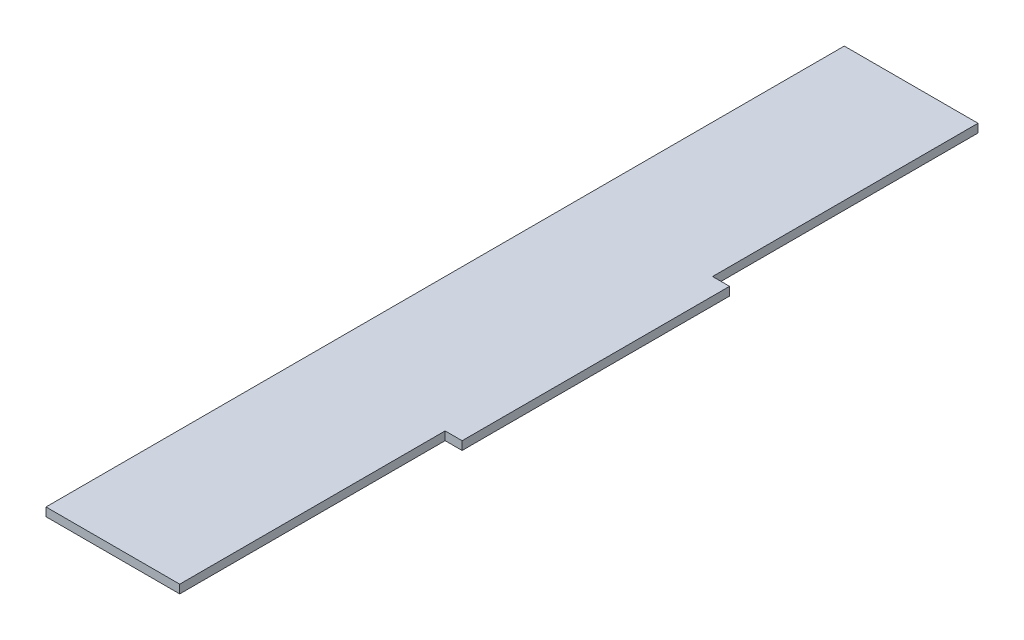
ISO-10303-21;
HEADER;
FILE_DESCRIPTION(('STEP AP214'),'2;1');
FILE_NAME('part.step','',(''),(''),'','','');
FILE_SCHEMA(('AUTOMOTIVE_DESIGN { 1 0 10303 214 1 1 1 1 }'));
ENDSEC;
DATA;
#1=APPLICATION_CONTEXT('core data for automotive mechanical design processes');
#2=APPLICATION_PROTOCOL_DEFINITION('international standard','automotive_design',2000,#1);
#3=PRODUCT_CONTEXT('',#1,'mechanical');
#4=PRODUCT('Part','Part','',(#3));
#5=PRODUCT_RELATED_PRODUCT_CATEGORY('part','',(#4));
#6=PRODUCT_DEFINITION_FORMATION('','',#4);
#7=PRODUCT_DEFINITION_CONTEXT('part definition',#1,'design');
#8=PRODUCT_DEFINITION('design','',#6,#7);
#9=PRODUCT_DEFINITION_SHAPE('','',#8);
#10=(LENGTH_UNIT() NAMED_UNIT(*) SI_UNIT(.MILLI.,.METRE.));
#11=(NAMED_UNIT(*) PLANE_ANGLE_UNIT() SI_UNIT($,.RADIAN.));
#12=(NAMED_UNIT(*) SI_UNIT($,.STERADIAN.) SOLID_ANGLE_UNIT());
#13=UNCERTAINTY_MEASURE_WITH_UNIT(LENGTH_MEASURE(1.E-05),#10,'distance_accuracy_value','');
#14=(GEOMETRIC_REPRESENTATION_CONTEXT(3) GLOBAL_UNCERTAINTY_ASSIGNED_CONTEXT((#13)) GLOBAL_UNIT_ASSIGNED_CONTEXT((#10,
#11,#12)) REPRESENTATION_CONTEXT('',''));
#15=CARTESIAN_POINT('',(0.,0.,0.));
#16=DIRECTION('',(0.,0.,1.));
#17=DIRECTION('',(1.,0.,0.));
#18=AXIS2_PLACEMENT_3D('',#15,#16,#17);
#19=CARTESIAN_POINT('',(-25.,3.175,0.));
#20=DIRECTION('',(-1.,0.,0.));
#21=DIRECTION('',(0.,0.,1.));
#22=AXIS2_PLACEMENT_3D('',#19,#20,#21);
#23=PLANE('',#22);
#24=DIRECTION('',(0.,0.,-1.));
#25=VECTOR('',#24,1.);
#26=CARTESIAN_POINT('',(-25.,0.,0.));
#27=LINE('',#26,#25);
#28=CARTESIAN_POINT('',(-25.,0.,199.25));
#29=VERTEX_POINT('',#28);
#30=CARTESIAN_POINT('',(-25.,0.,-99.25));
#31=VERTEX_POINT('',#30);
#32=EDGE_CURVE('E127',#29,#31,#27,.T.);
#33=ORIENTED_EDGE('',*,*,#32,.F.);
#34=DIRECTION('',(0.,-1.,0.));
#35=VECTOR('',#34,1.);
#36=CARTESIAN_POINT('',(-25.,3.175,199.25));
#37=LINE('',#36,#35);
#38=CARTESIAN_POINT('',(-25.,3.175,199.25));
#39=VERTEX_POINT('',#38);
#40=EDGE_CURVE('E11',#39,#29,#37,.T.);
#41=ORIENTED_EDGE('',*,*,#40,.F.);
#42=DIRECTION('',(0.,0.,-1.));
#43=VECTOR('',#42,1.);
#44=CARTESIAN_POINT('',(-25.,3.175,0.));
#45=LINE('',#44,#43);
#46=CARTESIAN_POINT('',(-25.,3.175,-99.25));
#47=VERTEX_POINT('',#46);
#48=EDGE_CURVE('E147',#39,#47,#45,.T.);
#49=ORIENTED_EDGE('',*,*,#48,.T.);
#50=DIRECTION('',(0.,-1.,0.));
#51=VECTOR('',#50,1.);
#52=CARTESIAN_POINT('',(-25.,3.175,-99.25));
#53=LINE('',#52,#51);
#54=EDGE_CURVE('E50',#47,#31,#53,.T.);
#55=ORIENTED_EDGE('',*,*,#54,.T.);
#56=EDGE_LOOP('',(#33,#41,#49,#55));
#57=FACE_BOUND('',#56,.T.);
#58=ADVANCED_FACE('F34',(#57),#23,.T.);
#59=CARTESIAN_POINT('',(0.,3.175,199.25));
#60=DIRECTION('',(0.,0.,1.));
#61=DIRECTION('',(1.,0.,0.));
#62=AXIS2_PLACEMENT_3D('',#59,#60,#61);
#63=PLANE('',#62);
#64=DIRECTION('',(-1.,0.,0.));
#65=VECTOR('',#64,1.);
#66=CARTESIAN_POINT('',(0.,0.,199.25));
#67=LINE('',#66,#65);
#68=CARTESIAN_POINT('',(25.,0.,199.25));
#69=VERTEX_POINT('',#68);
#70=EDGE_CURVE('E129',#69,#29,#67,.T.);
#71=ORIENTED_EDGE('',*,*,#70,.F.);
#72=DIRECTION('',(0.,-1.,0.));
#73=VECTOR('',#72,1.);
#74=CARTESIAN_POINT('',(25.,3.175,199.25));
#75=LINE('',#74,#73);
#76=CARTESIAN_POINT('',(25.,3.175,199.25));
#77=VERTEX_POINT('',#76);
#78=EDGE_CURVE('E42',#77,#69,#75,.T.);
#79=ORIENTED_EDGE('',*,*,#78,.F.);
#80=DIRECTION('',(-1.,0.,0.));
#81=VECTOR('',#80,1.);
#82=CARTESIAN_POINT('',(0.,3.175,199.25));
#83=LINE('',#82,#81);
#84=EDGE_CURVE('E173',#77,#39,#83,.T.);
#85=ORIENTED_EDGE('',*,*,#84,.T.);
#86=ORIENTED_EDGE('',*,*,#40,.T.);
#87=EDGE_LOOP('',(#71,#79,#85,#86));
#88=FACE_BOUND('',#87,.T.);
#89=ADVANCED_FACE('F164',(#88),#63,.T.);
#90=CARTESIAN_POINT('',(25.,3.175,0.));
#91=DIRECTION('',(1.,0.,0.));
#92=DIRECTION('',(0.,0.,-1.));
#93=AXIS2_PLACEMENT_3D('',#90,#91,#92);
#94=PLANE('',#93);
#95=DIRECTION('',(0.,0.,1.));
#96=VECTOR('',#95,1.);
#97=CARTESIAN_POINT('',(25.,0.,0.));
#98=LINE('',#97,#96);
#99=CARTESIAN_POINT('',(25.,0.,100.));
#100=VERTEX_POINT('',#99);
#101=EDGE_CURVE('E132',#100,#69,#98,.T.);
#102=ORIENTED_EDGE('',*,*,#101,.F.);
#103=DIRECTION('',(0.,-1.,0.));
#104=VECTOR('',#103,1.);
#105=CARTESIAN_POINT('',(25.,3.175,100.));
#106=LINE('',#105,#104);
#107=CARTESIAN_POINT('',(25.,3.175,100.));
#108=VERTEX_POINT('',#107);
#109=EDGE_CURVE('E153',#108,#100,#106,.T.);
#110=ORIENTED_EDGE('',*,*,#109,.F.);
#111=DIRECTION('',(0.,0.,1.));
#112=VECTOR('',#111,1.);
#113=CARTESIAN_POINT('',(25.,3.175,0.));
#114=LINE('',#113,#112);
#115=EDGE_CURVE('E160',#108,#77,#114,.T.);
#116=ORIENTED_EDGE('',*,*,#115,.T.);
#117=ORIENTED_EDGE('',*,*,#78,.T.);
#118=EDGE_LOOP('',(#102,#110,#116,#117));
#119=FACE_BOUND('',#118,.T.);
#120=ADVANCED_FACE('F158',(#119),#94,.T.);
#121=CARTESIAN_POINT('',(0.,3.175,100.));
#122=DIRECTION('',(0.,0.,1.));
#123=DIRECTION('',(1.,0.,0.));
#124=AXIS2_PLACEMENT_3D('',#121,#122,#123);
#125=PLANE('',#124);
#126=DIRECTION('',(-1.,0.,0.));
#127=VECTOR('',#126,1.);
#128=CARTESIAN_POINT('',(0.,0.,100.));
#129=LINE('',#128,#127);
#130=CARTESIAN_POINT('',(31.35,0.,100.));
#131=VERTEX_POINT('',#130);
#132=EDGE_CURVE('E135',#131,#100,#129,.T.);
#133=ORIENTED_EDGE('',*,*,#132,.F.);
#134=DIRECTION('',(0.,-1.,0.));
#135=VECTOR('',#134,1.);
#136=CARTESIAN_POINT('',(31.35,3.175,100.));
#137=LINE('',#136,#135);
#138=CARTESIAN_POINT('',(31.35,3.175,100.));
#139=VERTEX_POINT('',#138);
#140=EDGE_CURVE('E151',#139,#131,#137,.T.);
#141=ORIENTED_EDGE('',*,*,#140,.F.);
#142=DIRECTION('',(-1.,0.,0.));
#143=VECTOR('',#142,1.);
#144=CARTESIAN_POINT('',(0.,3.175,100.));
#145=LINE('',#144,#143);
#146=EDGE_CURVE('E172',#139,#108,#145,.T.);
#147=ORIENTED_EDGE('',*,*,#146,.T.);
#148=ORIENTED_EDGE('',*,*,#109,.T.);
#149=EDGE_LOOP('',(#133,#141,#147,#148));
#150=FACE_BOUND('',#149,.T.);
#151=ADVANCED_FACE('F170',(#150),#125,.T.);
#152=CARTESIAN_POINT('',(31.35,3.175,0.));
#153=DIRECTION('',(1.,0.,0.));
#154=DIRECTION('',(0.,0.,-1.));
#155=AXIS2_PLACEMENT_3D('',#152,#153,#154);
#156=PLANE('',#155);
#157=DIRECTION('',(0.,0.,1.));
#158=VECTOR('',#157,1.);
#159=CARTESIAN_POINT('',(31.35,0.,0.));
#160=LINE('',#159,#158);
#161=CARTESIAN_POINT('',(31.35,0.,0.));
#162=VERTEX_POINT('',#161);
#163=EDGE_CURVE('E138',#162,#131,#160,.T.);
#164=ORIENTED_EDGE('',*,*,#163,.F.);
#165=DIRECTION('',(0.,-1.,0.));
#166=VECTOR('',#165,1.);
#167=CARTESIAN_POINT('',(31.35,3.175,0.));
#168=LINE('',#167,#166);
#169=CARTESIAN_POINT('',(31.35,3.175,0.));
#170=VERTEX_POINT('',#169);
#171=EDGE_CURVE('E109',#170,#162,#168,.T.);
#172=ORIENTED_EDGE('',*,*,#171,.F.);
#173=DIRECTION('',(0.,0.,1.));
#174=VECTOR('',#173,1.);
#175=CARTESIAN_POINT('',(31.35,3.175,0.));
#176=LINE('',#175,#174);
#177=EDGE_CURVE('E119',#170,#139,#176,.T.);
#178=ORIENTED_EDGE('',*,*,#177,.T.);
#179=ORIENTED_EDGE('',*,*,#140,.T.);
#180=EDGE_LOOP('',(#164,#172,#178,#179));
#181=FACE_BOUND('',#180,.T.);
#182=ADVANCED_FACE('F179',(#181),#156,.T.);
#183=CARTESIAN_POINT('',(0.,3.175,0.));
#184=DIRECTION('',(0.,0.,-1.));
#185=DIRECTION('',(-1.,0.,0.));
#186=AXIS2_PLACEMENT_3D('',#183,#184,#185);
#187=PLANE('',#186);
#188=DIRECTION('',(1.,0.,0.));
#189=VECTOR('',#188,1.);
#190=CARTESIAN_POINT('',(0.,0.,0.));
#191=LINE('',#190,#189);
#192=CARTESIAN_POINT('',(25.,0.,0.));
#193=VERTEX_POINT('',#192);
#194=EDGE_CURVE('E105',#193,#162,#191,.T.);
#195=ORIENTED_EDGE('',*,*,#194,.F.);
#196=DIRECTION('',(0.,-1.,0.));
#197=VECTOR('',#196,1.);
#198=CARTESIAN_POINT('',(25.,3.175,0.));
#199=LINE('',#198,#197);
#200=CARTESIAN_POINT('',(25.,3.175,0.));
#201=VERTEX_POINT('',#200);
#202=EDGE_CURVE('E100',#201,#193,#199,.T.);
#203=ORIENTED_EDGE('',*,*,#202,.F.);
#204=DIRECTION('',(1.,0.,0.));
#205=VECTOR('',#204,1.);
#206=CARTESIAN_POINT('',(0.,3.175,0.));
#207=LINE('',#206,#205);
#208=EDGE_CURVE('E103',#201,#170,#207,.T.);
#209=ORIENTED_EDGE('',*,*,#208,.T.);
#210=ORIENTED_EDGE('',*,*,#171,.T.);
#211=EDGE_LOOP('',(#195,#203,#209,#210));
#212=FACE_BOUND('',#211,.T.);
#213=ADVANCED_FACE('F102',(#212),#187,.T.);
#214=CARTESIAN_POINT('',(25.,3.175,0.));
#215=DIRECTION('',(1.,0.,0.));
#216=DIRECTION('',(0.,0.,-1.));
#217=AXIS2_PLACEMENT_3D('',#214,#215,#216);
#218=PLANE('',#217);
#219=DIRECTION('',(0.,0.,1.));
#220=VECTOR('',#219,1.);
#221=CARTESIAN_POINT('',(25.,0.,0.));
#222=LINE('',#221,#220);
#223=CARTESIAN_POINT('',(25.,0.,-99.25));
#224=VERTEX_POINT('',#223);
#225=EDGE_CURVE('E142',#224,#193,#222,.T.);
#226=ORIENTED_EDGE('',*,*,#225,.F.);
#227=DIRECTION('',(0.,-1.,0.));
#228=VECTOR('',#227,1.);
#229=CARTESIAN_POINT('',(25.,3.175,-99.25));
#230=LINE('',#229,#228);
#231=CARTESIAN_POINT('',(25.,3.175,-99.25));
#232=VERTEX_POINT('',#231);
#233=EDGE_CURVE('E75',#232,#224,#230,.T.);
#234=ORIENTED_EDGE('',*,*,#233,.F.);
#235=DIRECTION('',(0.,0.,1.));
#236=VECTOR('',#235,1.);
#237=CARTESIAN_POINT('',(25.,3.175,0.));
#238=LINE('',#237,#236);
#239=EDGE_CURVE('E116',#232,#201,#238,.T.);
#240=ORIENTED_EDGE('',*,*,#239,.T.);
#241=ORIENTED_EDGE('',*,*,#202,.T.);
#242=EDGE_LOOP('',(#226,#234,#240,#241));
#243=FACE_BOUND('',#242,.T.);
#244=ADVANCED_FACE('F121',(#243),#218,.T.);
#245=CARTESIAN_POINT('',(0.,3.175,-99.25));
#246=DIRECTION('',(0.,0.,-1.));
#247=DIRECTION('',(-1.,0.,0.));
#248=AXIS2_PLACEMENT_3D('',#245,#246,#247);
#249=PLANE('',#248);
#250=DIRECTION('',(1.,0.,0.));
#251=VECTOR('',#250,1.);
#252=CARTESIAN_POINT('',(0.,0.,-99.25));
#253=LINE('',#252,#251);
#254=EDGE_CURVE('E144',#31,#224,#253,.T.);
#255=ORIENTED_EDGE('',*,*,#254,.F.);
#256=ORIENTED_EDGE('',*,*,#54,.F.);
#257=DIRECTION('',(1.,0.,0.));
#258=VECTOR('',#257,1.);
#259=CARTESIAN_POINT('',(0.,3.175,-99.25));
#260=LINE('',#259,#258);
#261=EDGE_CURVE('E122',#47,#232,#260,.T.);
#262=ORIENTED_EDGE('',*,*,#261,.T.);
#263=ORIENTED_EDGE('',*,*,#233,.T.);
#264=EDGE_LOOP('',(#255,#256,#262,#263));
#265=FACE_BOUND('',#264,.T.);
#266=ADVANCED_FACE('F180',(#265),#249,.T.);
#267=CARTESIAN_POINT('',(0.,3.175,0.));
#268=DIRECTION('',(0.,1.,0.));
#269=DIRECTION('',(0.,0.,1.));
#270=AXIS2_PLACEMENT_3D('',#267,#268,#269);
#271=PLANE('',#270);
#272=ORIENTED_EDGE('',*,*,#48,.F.);
#273=ORIENTED_EDGE('',*,*,#84,.F.);
#274=ORIENTED_EDGE('',*,*,#115,.F.);
#275=ORIENTED_EDGE('',*,*,#146,.F.);
#276=ORIENTED_EDGE('',*,*,#177,.F.);
#277=ORIENTED_EDGE('',*,*,#208,.F.);
#278=ORIENTED_EDGE('',*,*,#239,.F.);
#279=ORIENTED_EDGE('',*,*,#261,.F.);
#280=EDGE_LOOP('',(#272,#273,#274,#275,#276,#277,#278,#279));
#281=FACE_BOUND('',#280,.T.);
#282=ADVANCED_FACE('F114',(#281),#271,.T.);
#283=CARTESIAN_POINT('',(0.,0.,0.));
#284=DIRECTION('',(0.,1.,0.));
#285=DIRECTION('',(0.,0.,1.));
#286=AXIS2_PLACEMENT_3D('',#283,#284,#285);
#287=PLANE('',#286);
#288=ORIENTED_EDGE('',*,*,#32,.T.);
#289=ORIENTED_EDGE('',*,*,#254,.T.);
#290=ORIENTED_EDGE('',*,*,#225,.T.);
#291=ORIENTED_EDGE('',*,*,#194,.T.);
#292=ORIENTED_EDGE('',*,*,#163,.T.);
#293=ORIENTED_EDGE('',*,*,#132,.T.);
#294=ORIENTED_EDGE('',*,*,#101,.T.);
#295=ORIENTED_EDGE('',*,*,#70,.T.);
#296=EDGE_LOOP('',(#288,#289,#290,#291,#292,#293,#294,#295));
#297=FACE_BOUND('',#296,.T.);
#298=ADVANCED_FACE('F166',(#297),#287,.F.);
#299=CLOSED_SHELL('',(#58,#89,#120,#151,#182,#213,#244,#266,#282,#298));
#300=MANIFOLD_SOLID_BREP('B2',#299);
#301=ADVANCED_BREP_SHAPE_REPRESENTATION('',(#18,#300),#14);
#302=SHAPE_DEFINITION_REPRESENTATION(#9,#301);
ENDSEC;
END-ISO-10303-21;
